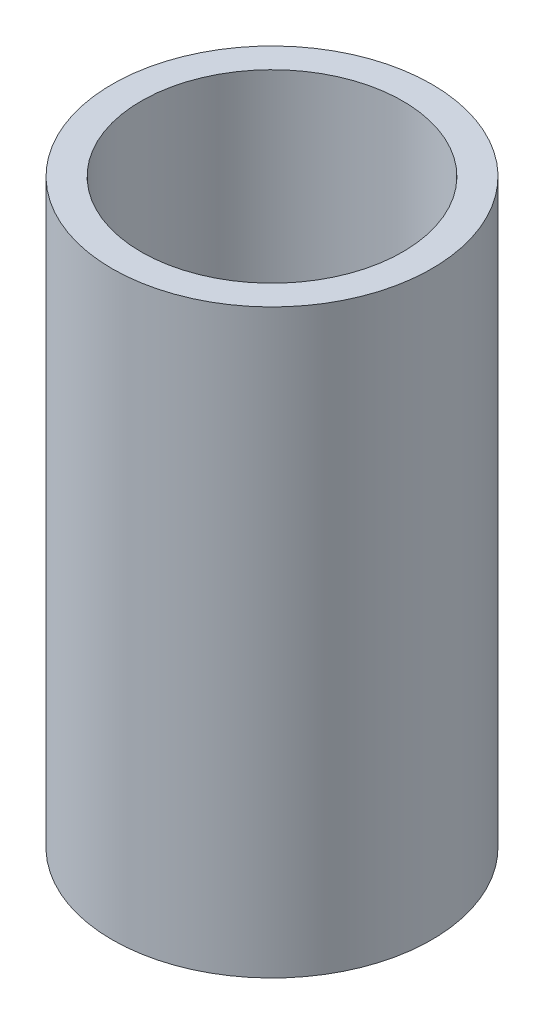
ISO-10303-21;
HEADER;
FILE_DESCRIPTION(('STEP AP214'),'2;1');
FILE_NAME('part.step','',(''),(''),'','','');
FILE_SCHEMA(('AUTOMOTIVE_DESIGN { 1 0 10303 214 1 1 1 1 }'));
ENDSEC;
DATA;
#1=APPLICATION_CONTEXT('core data for automotive mechanical design processes');
#2=APPLICATION_PROTOCOL_DEFINITION('international standard','automotive_design',2000,#1);
#3=PRODUCT_CONTEXT('',#1,'mechanical');
#4=PRODUCT('Part','Part','',(#3));
#5=PRODUCT_RELATED_PRODUCT_CATEGORY('part','',(#4));
#6=PRODUCT_DEFINITION_FORMATION('','',#4);
#7=PRODUCT_DEFINITION_CONTEXT('part definition',#1,'design');
#8=PRODUCT_DEFINITION('design','',#6,#7);
#9=PRODUCT_DEFINITION_SHAPE('','',#8);
#10=(LENGTH_UNIT() NAMED_UNIT(*) SI_UNIT(.MILLI.,.METRE.));
#11=(NAMED_UNIT(*) PLANE_ANGLE_UNIT() SI_UNIT($,.RADIAN.));
#12=(NAMED_UNIT(*) SI_UNIT($,.STERADIAN.) SOLID_ANGLE_UNIT());
#13=UNCERTAINTY_MEASURE_WITH_UNIT(LENGTH_MEASURE(1.E-05),#10,'distance_accuracy_value','');
#14=(GEOMETRIC_REPRESENTATION_CONTEXT(3) GLOBAL_UNCERTAINTY_ASSIGNED_CONTEXT((#13)) GLOBAL_UNIT_ASSIGNED_CONTEXT((#10,
#11,#12)) REPRESENTATION_CONTEXT('',''));
#15=CARTESIAN_POINT('',(0.,0.,0.));
#16=DIRECTION('',(0.,0.,1.));
#17=DIRECTION('',(1.,0.,0.));
#18=AXIS2_PLACEMENT_3D('',#15,#16,#17);
#19=CARTESIAN_POINT('',(0.,10.,0.));
#20=DIRECTION('',(0.,1.,0.));
#21=DIRECTION('',(0.,0.,1.));
#22=AXIS2_PLACEMENT_3D('',#19,#20,#21);
#23=PLANE('',#22);
#24=CARTESIAN_POINT('',(0.,10.,0.));
#25=DIRECTION('',(0.,1.,0.));
#26=DIRECTION('',(0.,0.,1.));
#27=AXIS2_PLACEMENT_3D('',#24,#25,#26);
#28=CIRCLE('',#27,2.75);
#29=CARTESIAN_POINT('',(0.,10.,2.75));
#30=VERTEX_POINT('',#29);
#31=EDGE_CURVE('E10',#30,#30,#28,.T.);
#32=ORIENTED_EDGE('',*,*,#31,.T.);
#33=EDGE_LOOP('',(#32));
#34=FACE_BOUND('',#33,.T.);
#35=CARTESIAN_POINT('',(0.,10.,0.));
#36=DIRECTION('',(0.,1.,0.));
#37=DIRECTION('',(0.,0.,1.));
#38=AXIS2_PLACEMENT_3D('',#35,#36,#37);
#39=CIRCLE('',#38,2.25);
#40=CARTESIAN_POINT('',(0.,10.,2.25));
#41=VERTEX_POINT('',#40);
#42=EDGE_CURVE('E43',#41,#41,#39,.T.);
#43=ORIENTED_EDGE('',*,*,#42,.F.);
#44=EDGE_LOOP('',(#43));
#45=FACE_BOUND('',#44,.T.);
#46=ADVANCED_FACE('F32',(#34,#45),#23,.T.);
#47=CARTESIAN_POINT('',(0.,0.,0.));
#48=DIRECTION('',(0.,1.,0.));
#49=DIRECTION('',(0.,0.,1.));
#50=AXIS2_PLACEMENT_3D('',#47,#48,#49);
#51=PLANE('',#50);
#52=CARTESIAN_POINT('',(0.,0.,0.));
#53=DIRECTION('',(0.,1.,0.));
#54=DIRECTION('',(0.,0.,1.));
#55=AXIS2_PLACEMENT_3D('',#52,#53,#54);
#56=CIRCLE('',#55,2.75);
#57=CARTESIAN_POINT('',(0.,0.,2.75));
#58=VERTEX_POINT('',#57);
#59=EDGE_CURVE('E36',#58,#58,#56,.T.);
#60=ORIENTED_EDGE('',*,*,#59,.F.);
#61=EDGE_LOOP('',(#60));
#62=FACE_BOUND('',#61,.T.);
#63=CARTESIAN_POINT('',(0.,0.,0.));
#64=DIRECTION('',(0.,1.,0.));
#65=DIRECTION('',(0.,0.,1.));
#66=AXIS2_PLACEMENT_3D('',#63,#64,#65);
#67=CIRCLE('',#66,2.25);
#68=CARTESIAN_POINT('',(0.,0.,2.25));
#69=VERTEX_POINT('',#68);
#70=EDGE_CURVE('E45',#69,#69,#67,.T.);
#71=ORIENTED_EDGE('',*,*,#70,.T.);
#72=EDGE_LOOP('',(#71));
#73=FACE_BOUND('',#72,.T.);
#74=ADVANCED_FACE('F55',(#62,#73),#51,.F.);
#75=CARTESIAN_POINT('',(0.,10.,0.));
#76=DIRECTION('',(0.,-1.,0.));
#77=DIRECTION('',(0.,0.,-1.));
#78=AXIS2_PLACEMENT_3D('',#75,#76,#77);
#79=CYLINDRICAL_SURFACE('',#78,2.75);
#80=ORIENTED_EDGE('',*,*,#31,.F.);
#81=EDGE_LOOP('',(#80));
#82=FACE_BOUND('',#81,.T.);
#83=ORIENTED_EDGE('',*,*,#59,.T.);
#84=EDGE_LOOP('',(#83));
#85=FACE_BOUND('',#84,.T.);
#86=ADVANCED_FACE('F34',(#82,#85),#79,.T.);
#87=CARTESIAN_POINT('',(0.,10.,0.));
#88=DIRECTION('',(0.,-1.,0.));
#89=DIRECTION('',(0.,0.,-1.));
#90=AXIS2_PLACEMENT_3D('',#87,#88,#89);
#91=CYLINDRICAL_SURFACE('',#90,2.25);
#92=ORIENTED_EDGE('',*,*,#42,.T.);
#93=EDGE_LOOP('',(#92));
#94=FACE_BOUND('',#93,.T.);
#95=ORIENTED_EDGE('',*,*,#70,.F.);
#96=EDGE_LOOP('',(#95));
#97=FACE_BOUND('',#96,.T.);
#98=ADVANCED_FACE('F51',(#94,#97),#91,.F.);
#99=CLOSED_SHELL('',(#46,#74,#86,#98));
#100=MANIFOLD_SOLID_BREP('B2',#99);
#101=ADVANCED_BREP_SHAPE_REPRESENTATION('',(#18,#100),#14);
#102=SHAPE_DEFINITION_REPRESENTATION(#9,#101);
ENDSEC;
END-ISO-10303-21;
